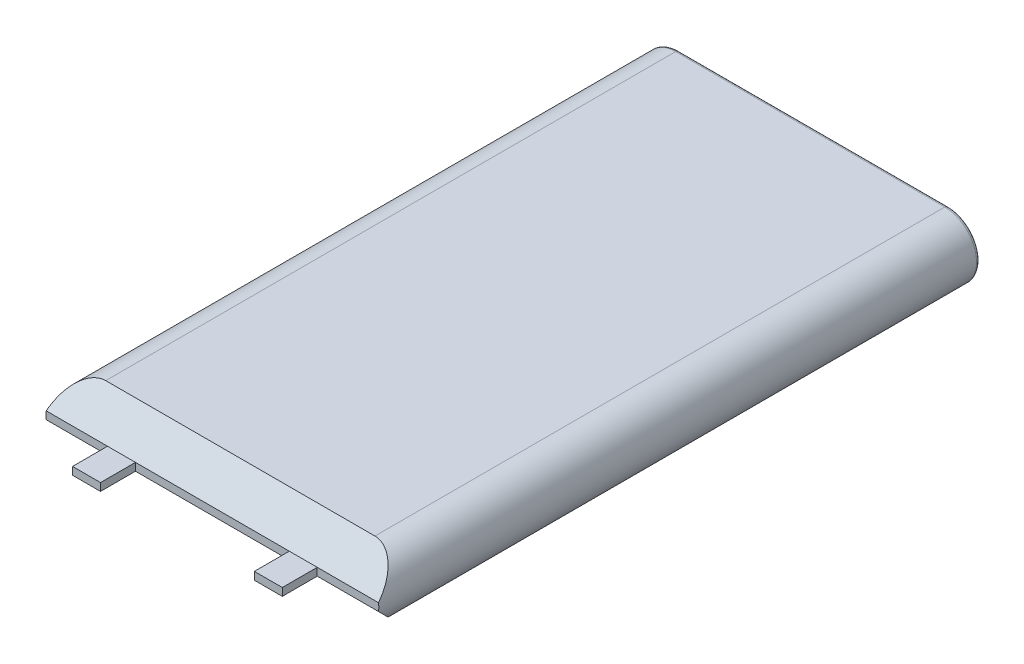
ISO-10303-21;
HEADER;
FILE_DESCRIPTION(('STEP AP214'),'2;1');
FILE_NAME('part.step','',(''),(''),'','','');
FILE_SCHEMA(('AUTOMOTIVE_DESIGN { 1 0 10303 214 1 1 1 1 }'));
ENDSEC;
DATA;
#1=APPLICATION_CONTEXT('core data for automotive mechanical design processes');
#2=APPLICATION_PROTOCOL_DEFINITION('international standard','automotive_design',2000,#1);
#3=PRODUCT_CONTEXT('',#1,'mechanical');
#4=PRODUCT('Part','Part','',(#3));
#5=PRODUCT_RELATED_PRODUCT_CATEGORY('part','',(#4));
#6=PRODUCT_DEFINITION_FORMATION('','',#4);
#7=PRODUCT_DEFINITION_CONTEXT('part definition',#1,'design');
#8=PRODUCT_DEFINITION('design','',#6,#7);
#9=PRODUCT_DEFINITION_SHAPE('','',#8);
#10=(LENGTH_UNIT() NAMED_UNIT(*) SI_UNIT(.MILLI.,.METRE.));
#11=(NAMED_UNIT(*) PLANE_ANGLE_UNIT() SI_UNIT($,.RADIAN.));
#12=(NAMED_UNIT(*) SI_UNIT($,.STERADIAN.) SOLID_ANGLE_UNIT());
#13=UNCERTAINTY_MEASURE_WITH_UNIT(LENGTH_MEASURE(1.E-05),#10,'distance_accuracy_value','');
#14=(GEOMETRIC_REPRESENTATION_CONTEXT(3) GLOBAL_UNCERTAINTY_ASSIGNED_CONTEXT((#13)) GLOBAL_UNIT_ASSIGNED_CONTEXT((#10,
#11,#12)) REPRESENTATION_CONTEXT('',''));
#15=CARTESIAN_POINT('',(0.,0.,0.));
#16=DIRECTION('',(0.,0.,1.));
#17=DIRECTION('',(1.,0.,0.));
#18=AXIS2_PLACEMENT_3D('',#15,#16,#17);
#19=CARTESIAN_POINT('',(-24.4475,0.,109.22));
#20=DIRECTION('',(0.,0.,1.));
#21=DIRECTION('',(1.,0.,0.));
#22=AXIS2_PLACEMENT_3D('',#19,#20,#21);
#23=PLANE('',#22);
#24=DIRECTION('',(-1.,0.,0.));
#25=VECTOR('',#24,1.);
#26=CARTESIAN_POINT('',(-24.4475,0.698500000000017,109.22));
#27=LINE('',#26,#25);
#28=CARTESIAN_POINT('',(30.1836276136432,0.698500000000025,109.22));
#29=VERTEX_POINT('',#28);
#30=CARTESIAN_POINT('',(19.05,0.698500000000024,109.22));
#31=VERTEX_POINT('',#30);
#32=EDGE_CURVE('E257',#29,#31,#27,.T.);
#33=ORIENTED_EDGE('',*,*,#32,.T.);
#34=DIRECTION('',(0.,1.,0.));
#35=VECTOR('',#34,1.);
#36=CARTESIAN_POINT('',(19.05,0.698500000000022,109.22));
#37=LINE('',#36,#35);
#38=CARTESIAN_POINT('',(19.05,-0.698500000000029,109.22));
#39=VERTEX_POINT('',#38);
#40=EDGE_CURVE('E51',#39,#31,#37,.T.);
#41=ORIENTED_EDGE('',*,*,#40,.F.);
#42=DIRECTION('',(1.,0.,0.));
#43=VECTOR('',#42,1.);
#44=CARTESIAN_POINT('',(24.4475,-0.698500000000027,109.22));
#45=LINE('',#44,#43);
#46=CARTESIAN_POINT('',(30.1836276136432,-0.698500000000026,109.22));
#47=VERTEX_POINT('',#46);
#48=EDGE_CURVE('E259',#39,#47,#45,.T.);
#49=ORIENTED_EDGE('',*,*,#48,.T.);
#50=CARTESIAN_POINT('',(24.4475,0.,109.22));
#51=DIRECTION('',(0.,0.,1.));
#52=DIRECTION('',(1.,0.,0.));
#53=AXIS2_PLACEMENT_3D('',#50,#51,#52);
#54=CIRCLE('',#53,5.7785);
#55=EDGE_CURVE('E214',#47,#29,#54,.T.);
#56=ORIENTED_EDGE('',*,*,#55,.T.);
#57=EDGE_LOOP('',(#33,#41,#49,#56));
#58=FACE_BOUND('',#57,.T.);
#59=ADVANCED_FACE('F35',(#58),#23,.T.);
#60=CARTESIAN_POINT('',(-13.97,-0.698500000000037,109.22));
#61=VERTEX_POINT('',#60);
#62=CARTESIAN_POINT('',(13.97,-0.69850000000003,109.22));
#63=VERTEX_POINT('',#62);
#64=EDGE_CURVE('E265',#61,#63,#45,.T.);
#65=ORIENTED_EDGE('',*,*,#64,.T.);
#66=DIRECTION('',(0.,-1.,0.));
#67=VECTOR('',#66,1.);
#68=CARTESIAN_POINT('',(13.97,0.698500000000021,109.22));
#69=LINE('',#68,#67);
#70=CARTESIAN_POINT('',(13.97,0.698500000000021,109.22));
#71=VERTEX_POINT('',#70);
#72=EDGE_CURVE('E433',#71,#63,#69,.T.);
#73=ORIENTED_EDGE('',*,*,#72,.F.);
#74=CARTESIAN_POINT('',(-13.97,0.698500000000018,109.22));
#75=VERTEX_POINT('',#74);
#76=EDGE_CURVE('E260',#71,#75,#27,.T.);
#77=ORIENTED_EDGE('',*,*,#76,.T.);
#78=DIRECTION('',(0.,1.,0.));
#79=VECTOR('',#78,1.);
#80=CARTESIAN_POINT('',(-13.97,0.698500000000018,109.22));
#81=LINE('',#80,#79);
#82=EDGE_CURVE('E194',#61,#75,#81,.T.);
#83=ORIENTED_EDGE('',*,*,#82,.F.);
#84=EDGE_LOOP('',(#65,#73,#77,#83));
#85=FACE_BOUND('',#84,.T.);
#86=ADVANCED_FACE('F314',(#85),#23,.T.);
#87=DIRECTION('',(0.,-1.,0.));
#88=VECTOR('',#87,1.);
#89=CARTESIAN_POINT('',(-19.05,0.698500000000018,109.22));
#90=LINE('',#89,#88);
#91=CARTESIAN_POINT('',(-19.05,0.698500000000018,109.22));
#92=VERTEX_POINT('',#91);
#93=CARTESIAN_POINT('',(-19.05,-0.698500000000039,109.22));
#94=VERTEX_POINT('',#93);
#95=EDGE_CURVE('E172',#92,#94,#90,.T.);
#96=ORIENTED_EDGE('',*,*,#95,.F.);
#97=CARTESIAN_POINT('',(-30.1836276136432,0.698500000000016,109.22));
#98=VERTEX_POINT('',#97);
#99=EDGE_CURVE('E247',#92,#98,#27,.T.);
#100=ORIENTED_EDGE('',*,*,#99,.T.);
#101=CARTESIAN_POINT('',(-24.4475,0.,109.22));
#102=DIRECTION('',(0.,0.,1.));
#103=DIRECTION('',(1.,0.,0.));
#104=AXIS2_PLACEMENT_3D('',#101,#102,#103);
#105=CIRCLE('',#104,5.7785);
#106=CARTESIAN_POINT('',(-30.1836276136432,-0.698500000000042,109.22));
#107=VERTEX_POINT('',#106);
#108=EDGE_CURVE('E211',#98,#107,#105,.T.);
#109=ORIENTED_EDGE('',*,*,#108,.T.);
#110=EDGE_CURVE('E261',#107,#94,#45,.T.);
#111=ORIENTED_EDGE('',*,*,#110,.T.);
#112=EDGE_LOOP('',(#96,#100,#109,#111));
#113=FACE_BOUND('',#112,.T.);
#114=ADVANCED_FACE('F280',(#113),#23,.T.);
#115=CARTESIAN_POINT('',(-24.4475,0.,109.22));
#116=DIRECTION('',(0.,0.,-1.));
#117=DIRECTION('',(-1.,0.,0.));
#118=AXIS2_PLACEMENT_3D('',#115,#116,#117);
#119=CYLINDRICAL_SURFACE('',#118,5.7785);
#120=DIRECTION('',(0.,0.,-1.));
#121=VECTOR('',#120,1.);
#122=CARTESIAN_POINT('',(-24.4475,-5.77850000000001,109.22));
#123=LINE('',#122,#121);
#124=CARTESIAN_POINT('',(-24.4475,-5.77850000000001,104.14));
#125=VERTEX_POINT('',#124);
#126=CARTESIAN_POINT('',(-24.4475,-5.77850000000001,0.634999999999997));
#127=VERTEX_POINT('',#126);
#128=EDGE_CURVE('E224',#125,#127,#123,.T.);
#129=ORIENTED_EDGE('',*,*,#128,.F.);
#130=CARTESIAN_POINT('',(-24.4475,0.,109.9185));
#131=DIRECTION('',(0.,-0.70710678118655,0.707106781186546));
#132=DIRECTION('',(0.,-0.707106781186546,-0.70710678118655));
#133=AXIS2_PLACEMENT_3D('',#130,#131,#132);
#134=ELLIPSE('',#133,8.17203307017295,5.7785);
#135=EDGE_CURVE('E44',#125,#107,#134,.F.);
#136=ORIENTED_EDGE('',*,*,#135,.T.);
#137=ORIENTED_EDGE('',*,*,#108,.F.);
#138=CARTESIAN_POINT('',(-24.4475,0.,109.9185));
#139=DIRECTION('',(0.,0.707106781186549,0.707106781186546));
#140=DIRECTION('',(0.,0.707106781186546,-0.707106781186549));
#141=AXIS2_PLACEMENT_3D('',#138,#139,#140);
#142=ELLIPSE('',#141,8.17203307017295,5.7785);
#143=CARTESIAN_POINT('',(-24.4475,5.77849999999999,104.14));
#144=VERTEX_POINT('',#143);
#145=EDGE_CURVE('E271',#98,#144,#142,.F.);
#146=ORIENTED_EDGE('',*,*,#145,.T.);
#147=DIRECTION('',(0.,0.,-1.));
#148=VECTOR('',#147,1.);
#149=CARTESIAN_POINT('',(-24.4475,5.77849999999999,109.22));
#150=LINE('',#149,#148);
#151=CARTESIAN_POINT('',(-24.4475,5.77849999999999,0.634999999999997));
#152=VERTEX_POINT('',#151);
#153=EDGE_CURVE('E218',#144,#152,#150,.T.);
#154=ORIENTED_EDGE('',*,*,#153,.T.);
#155=CARTESIAN_POINT('',(-24.4475,0.,0.634999999999997));
#156=DIRECTION('',(0.,0.,1.));
#157=DIRECTION('',(1.,0.,0.));
#158=AXIS2_PLACEMENT_3D('',#155,#156,#157);
#159=CIRCLE('',#158,5.7785);
#160=EDGE_CURVE('E244',#152,#127,#159,.T.);
#161=ORIENTED_EDGE('',*,*,#160,.T.);
#162=EDGE_LOOP('',(#129,#136,#137,#146,#154,#161));
#163=FACE_BOUND('',#162,.T.);
#164=ADVANCED_FACE('F276',(#163),#119,.T.);
#165=CARTESIAN_POINT('',(24.4475,-5.7785,109.22));
#166=DIRECTION('',(0.,1.,0.));
#167=DIRECTION('',(-1.,0.,0.));
#168=AXIS2_PLACEMENT_3D('',#165,#166,#167);
#169=PLANE('',#168);
#170=DIRECTION('',(0.,0.,-1.));
#171=VECTOR('',#170,1.);
#172=CARTESIAN_POINT('',(24.4475,-5.7785,109.22));
#173=LINE('',#172,#171);
#174=CARTESIAN_POINT('',(24.4475,-5.7785,104.14));
#175=VERTEX_POINT('',#174);
#176=CARTESIAN_POINT('',(24.4475,-5.7785,0.634999999999997));
#177=VERTEX_POINT('',#176);
#178=EDGE_CURVE('E222',#175,#177,#173,.T.);
#179=ORIENTED_EDGE('',*,*,#178,.F.);
#180=DIRECTION('',(-1.,0.,0.));
#181=VECTOR('',#180,1.);
#182=CARTESIAN_POINT('',(-24.4475,-5.77850000000001,104.14));
#183=LINE('',#182,#181);
#184=EDGE_CURVE('E269',#175,#125,#183,.T.);
#185=ORIENTED_EDGE('',*,*,#184,.T.);
#186=ORIENTED_EDGE('',*,*,#128,.T.);
#187=DIRECTION('',(1.,0.,0.));
#188=VECTOR('',#187,1.);
#189=CARTESIAN_POINT('',(24.4475,-5.7785,0.634999999999997));
#190=LINE('',#189,#188);
#191=EDGE_CURVE('E226',#127,#177,#190,.T.);
#192=ORIENTED_EDGE('',*,*,#191,.T.);
#193=EDGE_LOOP('',(#179,#185,#186,#192));
#194=FACE_BOUND('',#193,.T.);
#195=ADVANCED_FACE('F326',(#194),#169,.F.);
#196=CARTESIAN_POINT('',(24.4475,0.,109.22));
#197=DIRECTION('',(0.,0.,-1.));
#198=DIRECTION('',(-1.,0.,0.));
#199=AXIS2_PLACEMENT_3D('',#196,#197,#198);
#200=CYLINDRICAL_SURFACE('',#199,5.7785);
#201=ORIENTED_EDGE('',*,*,#55,.F.);
#202=CARTESIAN_POINT('',(24.4475,0.,109.9185));
#203=DIRECTION('',(0.,-0.70710678118655,0.707106781186546));
#204=DIRECTION('',(0.,-0.707106781186546,-0.70710678118655));
#205=AXIS2_PLACEMENT_3D('',#202,#203,#204);
#206=ELLIPSE('',#205,8.17203307017295,5.7785);
#207=EDGE_CURVE('E267',#47,#175,#206,.F.);
#208=ORIENTED_EDGE('',*,*,#207,.T.);
#209=ORIENTED_EDGE('',*,*,#178,.T.);
#210=CARTESIAN_POINT('',(24.4475,0.,0.634999999999997));
#211=DIRECTION('',(0.,0.,1.));
#212=DIRECTION('',(1.,0.,0.));
#213=AXIS2_PLACEMENT_3D('',#210,#211,#212);
#214=CIRCLE('',#213,5.7785);
#215=CARTESIAN_POINT('',(24.4475,5.7785,0.634999999999997));
#216=VERTEX_POINT('',#215);
#217=EDGE_CURVE('E238',#177,#216,#214,.T.);
#218=ORIENTED_EDGE('',*,*,#217,.T.);
#219=DIRECTION('',(0.,0.,-1.));
#220=VECTOR('',#219,1.);
#221=CARTESIAN_POINT('',(24.4475,5.7785,109.22));
#222=LINE('',#221,#220);
#223=CARTESIAN_POINT('',(24.4475,5.7785,104.14));
#224=VERTEX_POINT('',#223);
#225=EDGE_CURVE('E220',#224,#216,#222,.T.);
#226=ORIENTED_EDGE('',*,*,#225,.F.);
#227=CARTESIAN_POINT('',(24.4475,0.,109.9185));
#228=DIRECTION('',(0.,0.707106781186549,0.707106781186546));
#229=DIRECTION('',(0.,0.707106781186546,-0.707106781186549));
#230=AXIS2_PLACEMENT_3D('',#227,#228,#229);
#231=ELLIPSE('',#230,8.17203307017295,5.7785);
#232=EDGE_CURVE('E264',#224,#29,#231,.F.);
#233=ORIENTED_EDGE('',*,*,#232,.T.);
#234=EDGE_LOOP('',(#201,#208,#209,#218,#226,#233));
#235=FACE_BOUND('',#234,.T.);
#236=ADVANCED_FACE('F331',(#235),#200,.T.);
#237=CARTESIAN_POINT('',(24.4475,5.7785,109.22));
#238=DIRECTION('',(0.,-1.,0.));
#239=DIRECTION('',(1.,0.,0.));
#240=AXIS2_PLACEMENT_3D('',#237,#238,#239);
#241=PLANE('',#240);
#242=ORIENTED_EDGE('',*,*,#153,.F.);
#243=DIRECTION('',(1.,0.,0.));
#244=VECTOR('',#243,1.);
#245=CARTESIAN_POINT('',(24.4475,5.7785,104.14));
#246=LINE('',#245,#244);
#247=EDGE_CURVE('E11',#144,#224,#246,.T.);
#248=ORIENTED_EDGE('',*,*,#247,.T.);
#249=ORIENTED_EDGE('',*,*,#225,.T.);
#250=DIRECTION('',(-1.,0.,0.));
#251=VECTOR('',#250,1.);
#252=CARTESIAN_POINT('',(24.4475,5.7785,0.634999999999997));
#253=LINE('',#252,#251);
#254=EDGE_CURVE('E241',#216,#152,#253,.T.);
#255=ORIENTED_EDGE('',*,*,#254,.T.);
#256=EDGE_LOOP('',(#242,#248,#249,#255));
#257=FACE_BOUND('',#256,.T.);
#258=ADVANCED_FACE('F452',(#257),#241,.F.);
#259=CARTESIAN_POINT('',(-24.4475,0.,0.));
#260=DIRECTION('',(0.,0.,1.));
#261=DIRECTION('',(1.,0.,0.));
#262=AXIS2_PLACEMENT_3D('',#259,#260,#261);
#263=PLANE('',#262);
#264=CARTESIAN_POINT('',(24.4475,0.,0.));
#265=DIRECTION('',(0.,0.,1.));
#266=DIRECTION('',(1.,0.,0.));
#267=AXIS2_PLACEMENT_3D('',#264,#265,#266);
#268=CIRCLE('',#267,5.1435);
#269=CARTESIAN_POINT('',(24.4475,5.1435,0.));
#270=VERTEX_POINT('',#269);
#271=CARTESIAN_POINT('',(24.4475,-5.1435,0.));
#272=VERTEX_POINT('',#271);
#273=EDGE_CURVE('E233',#270,#272,#268,.F.);
#274=ORIENTED_EDGE('',*,*,#273,.T.);
#275=DIRECTION('',(1.,0.,0.));
#276=VECTOR('',#275,1.);
#277=CARTESIAN_POINT('',(-24.4475,-5.14350000000001,0.));
#278=LINE('',#277,#276);
#279=CARTESIAN_POINT('',(-24.4475,-5.14350000000001,0.));
#280=VERTEX_POINT('',#279);
#281=EDGE_CURVE('E235',#272,#280,#278,.F.);
#282=ORIENTED_EDGE('',*,*,#281,.T.);
#283=CARTESIAN_POINT('',(-24.4475,0.,0.));
#284=DIRECTION('',(0.,0.,1.));
#285=DIRECTION('',(1.,0.,0.));
#286=AXIS2_PLACEMENT_3D('',#283,#284,#285);
#287=CIRCLE('',#286,5.1435);
#288=CARTESIAN_POINT('',(-24.4475,5.14349999999999,0.));
#289=VERTEX_POINT('',#288);
#290=EDGE_CURVE('E229',#280,#289,#287,.F.);
#291=ORIENTED_EDGE('',*,*,#290,.T.);
#292=DIRECTION('',(-1.,0.,0.));
#293=VECTOR('',#292,1.);
#294=CARTESIAN_POINT('',(-24.4475,5.14349999999999,0.));
#295=LINE('',#294,#293);
#296=EDGE_CURVE('E231',#289,#270,#295,.F.);
#297=ORIENTED_EDGE('',*,*,#296,.T.);
#298=EDGE_LOOP('',(#274,#282,#291,#297));
#299=FACE_BOUND('',#298,.T.);
#300=ADVANCED_FACE('F350',(#299),#263,.F.);
#301=CARTESIAN_POINT('',(24.4475,5.1435,0.634999999999997));
#302=DIRECTION('',(-1.,0.,0.));
#303=DIRECTION('',(0.,-1.,0.));
#304=AXIS2_PLACEMENT_3D('',#301,#302,#303);
#305=CYLINDRICAL_SURFACE('',#304,0.635);
#306=CARTESIAN_POINT('',(24.4475,5.1435,0.635));
#307=DIRECTION('',(1.,0.,0.));
#308=DIRECTION('',(0.,0.,-1.));
#309=AXIS2_PLACEMENT_3D('',#306,#307,#308);
#310=CIRCLE('',#309,0.635);
#311=EDGE_CURVE('E252',#270,#216,#310,.T.);
#312=ORIENTED_EDGE('',*,*,#311,.F.);
#313=ORIENTED_EDGE('',*,*,#296,.F.);
#314=CARTESIAN_POINT('',(-24.4475,5.14349999999999,0.634999999999997));
#315=DIRECTION('',(-1.,0.,0.));
#316=DIRECTION('',(0.,0.,1.));
#317=AXIS2_PLACEMENT_3D('',#314,#315,#316);
#318=CIRCLE('',#317,0.635);
#319=EDGE_CURVE('E215',#152,#289,#318,.T.);
#320=ORIENTED_EDGE('',*,*,#319,.F.);
#321=ORIENTED_EDGE('',*,*,#254,.F.);
#322=EDGE_LOOP('',(#312,#313,#320,#321));
#323=FACE_BOUND('',#322,.T.);
#324=ADVANCED_FACE('F347',(#323),#305,.T.);
#325=CARTESIAN_POINT('',(-24.4475,0.,0.634999999999997));
#326=DIRECTION('',(0.,0.,1.));
#327=DIRECTION('',(1.,0.,0.));
#328=AXIS2_PLACEMENT_3D('',#325,#326,#327);
#329=TOROIDAL_SURFACE('',#328,5.1435,0.635);
#330=ORIENTED_EDGE('',*,*,#319,.T.);
#331=ORIENTED_EDGE('',*,*,#290,.F.);
#332=CARTESIAN_POINT('',(-24.4475,-5.14350000000001,0.634999999999997));
#333=DIRECTION('',(1.,0.,0.));
#334=DIRECTION('',(0.,0.,-1.));
#335=AXIS2_PLACEMENT_3D('',#332,#333,#334);
#336=CIRCLE('',#335,0.635);
#337=EDGE_CURVE('E250',#127,#280,#336,.T.);
#338=ORIENTED_EDGE('',*,*,#337,.F.);
#339=ORIENTED_EDGE('',*,*,#160,.F.);
#340=EDGE_LOOP('',(#330,#331,#338,#339));
#341=FACE_BOUND('',#340,.T.);
#342=ADVANCED_FACE('F343',(#341),#329,.T.);
#343=CARTESIAN_POINT('',(24.4475,0.,0.634999999999997));
#344=DIRECTION('',(0.,0.,1.));
#345=DIRECTION('',(1.,0.,0.));
#346=AXIS2_PLACEMENT_3D('',#343,#344,#345);
#347=TOROIDAL_SURFACE('',#346,5.1435,0.635);
#348=ORIENTED_EDGE('',*,*,#311,.T.);
#349=ORIENTED_EDGE('',*,*,#217,.F.);
#350=CARTESIAN_POINT('',(24.4475,-5.1435,0.635));
#351=DIRECTION('',(-1.,0.,0.));
#352=DIRECTION('',(0.,0.,1.));
#353=AXIS2_PLACEMENT_3D('',#350,#351,#352);
#354=CIRCLE('',#353,0.635);
#355=EDGE_CURVE('E210',#272,#177,#354,.T.);
#356=ORIENTED_EDGE('',*,*,#355,.F.);
#357=ORIENTED_EDGE('',*,*,#273,.F.);
#358=EDGE_LOOP('',(#348,#349,#356,#357));
#359=FACE_BOUND('',#358,.T.);
#360=ADVANCED_FACE('F339',(#359),#347,.T.);
#361=CARTESIAN_POINT('',(24.4475,-5.1435,0.634999999999997));
#362=DIRECTION('',(1.,0.,0.));
#363=DIRECTION('',(0.,1.,0.));
#364=AXIS2_PLACEMENT_3D('',#361,#362,#363);
#365=CYLINDRICAL_SURFACE('',#364,0.635);
#366=ORIENTED_EDGE('',*,*,#337,.T.);
#367=ORIENTED_EDGE('',*,*,#281,.F.);
#368=ORIENTED_EDGE('',*,*,#355,.T.);
#369=ORIENTED_EDGE('',*,*,#191,.F.);
#370=EDGE_LOOP('',(#366,#367,#368,#369));
#371=FACE_BOUND('',#370,.T.);
#372=ADVANCED_FACE('F336',(#371),#365,.T.);
#373=CARTESIAN_POINT('',(-24.4475,-0.69850000000004,109.22));
#374=DIRECTION('',(0.,-0.70710678118655,0.707106781186546));
#375=DIRECTION('',(-1.,0.,0.));
#376=AXIS2_PLACEMENT_3D('',#373,#374,#375);
#377=PLANE('',#376);
#378=ORIENTED_EDGE('',*,*,#135,.F.);
#379=ORIENTED_EDGE('',*,*,#184,.F.);
#380=ORIENTED_EDGE('',*,*,#207,.F.);
#381=ORIENTED_EDGE('',*,*,#48,.F.);
#382=DIRECTION('',(1.,0.,0.));
#383=VECTOR('',#382,1.);
#384=CARTESIAN_POINT('',(19.05,-0.698500000000036,109.22));
#385=LINE('',#384,#383);
#386=EDGE_CURVE('E58',#63,#39,#385,.T.);
#387=ORIENTED_EDGE('',*,*,#386,.F.);
#388=ORIENTED_EDGE('',*,*,#64,.F.);
#389=DIRECTION('',(1.,0.,0.));
#390=VECTOR('',#389,1.);
#391=CARTESIAN_POINT('',(-19.05,-0.698500000000041,109.22));
#392=LINE('',#391,#390);
#393=EDGE_CURVE('E175',#94,#61,#392,.T.);
#394=ORIENTED_EDGE('',*,*,#393,.F.);
#395=ORIENTED_EDGE('',*,*,#110,.F.);
#396=EDGE_LOOP('',(#378,#379,#380,#381,#387,#388,#394,#395));
#397=FACE_BOUND('',#396,.T.);
#398=ADVANCED_FACE('F283',(#397),#377,.T.);
#399=CARTESIAN_POINT('',(-24.4475,0.698500000000017,109.22));
#400=DIRECTION('',(0.,0.707106781186549,0.707106781186546));
#401=DIRECTION('',(1.,0.,0.));
#402=AXIS2_PLACEMENT_3D('',#399,#400,#401);
#403=PLANE('',#402);
#404=ORIENTED_EDGE('',*,*,#232,.F.);
#405=ORIENTED_EDGE('',*,*,#247,.F.);
#406=ORIENTED_EDGE('',*,*,#145,.F.);
#407=ORIENTED_EDGE('',*,*,#99,.F.);
#408=DIRECTION('',(-1.,0.,0.));
#409=VECTOR('',#408,1.);
#410=CARTESIAN_POINT('',(-19.05,0.698500000000018,109.22));
#411=LINE('',#410,#409);
#412=EDGE_CURVE('E185',#75,#92,#411,.T.);
#413=ORIENTED_EDGE('',*,*,#412,.F.);
#414=ORIENTED_EDGE('',*,*,#76,.F.);
#415=DIRECTION('',(-1.,0.,0.));
#416=VECTOR('',#415,1.);
#417=CARTESIAN_POINT('',(19.05,0.698500000000022,109.22));
#418=LINE('',#417,#416);
#419=EDGE_CURVE('E440',#31,#71,#418,.T.);
#420=ORIENTED_EDGE('',*,*,#419,.F.);
#421=ORIENTED_EDGE('',*,*,#32,.F.);
#422=EDGE_LOOP('',(#404,#405,#406,#407,#413,#414,#420,#421));
#423=FACE_BOUND('',#422,.T.);
#424=ADVANCED_FACE('F38',(#423),#403,.T.);
#425=CARTESIAN_POINT('',(-19.05,0.698500000000018,115.57));
#426=DIRECTION('',(1.,0.,0.));
#427=DIRECTION('',(0.,0.,-1.));
#428=AXIS2_PLACEMENT_3D('',#425,#426,#427);
#429=PLANE('',#428);
#430=ORIENTED_EDGE('',*,*,#95,.T.);
#431=DIRECTION('',(0.,0.,-1.));
#432=VECTOR('',#431,1.);
#433=CARTESIAN_POINT('',(-19.05,-0.698500000000041,115.57));
#434=LINE('',#433,#432);
#435=CARTESIAN_POINT('',(-19.05,-0.698500000000041,115.57));
#436=VERTEX_POINT('',#435);
#437=EDGE_CURVE('E207',#436,#94,#434,.T.);
#438=ORIENTED_EDGE('',*,*,#437,.F.);
#439=DIRECTION('',(0.,-1.,0.));
#440=VECTOR('',#439,1.);
#441=CARTESIAN_POINT('',(-19.05,0.698500000000018,115.57));
#442=LINE('',#441,#440);
#443=CARTESIAN_POINT('',(-19.05,0.698500000000018,115.57));
#444=VERTEX_POINT('',#443);
#445=EDGE_CURVE('E181',#444,#436,#442,.T.);
#446=ORIENTED_EDGE('',*,*,#445,.F.);
#447=DIRECTION('',(0.,0.,-1.));
#448=VECTOR('',#447,1.);
#449=CARTESIAN_POINT('',(-19.05,0.698500000000018,115.57));
#450=LINE('',#449,#448);
#451=EDGE_CURVE('E190',#444,#92,#450,.T.);
#452=ORIENTED_EDGE('',*,*,#451,.T.);
#453=EDGE_LOOP('',(#430,#438,#446,#452));
#454=FACE_BOUND('',#453,.T.);
#455=ADVANCED_FACE('F298',(#454),#429,.F.);
#456=CARTESIAN_POINT('',(-19.05,-0.698500000000041,115.57));
#457=DIRECTION('',(0.,1.,0.));
#458=DIRECTION('',(0.,0.,1.));
#459=AXIS2_PLACEMENT_3D('',#456,#457,#458);
#460=PLANE('',#459);
#461=ORIENTED_EDGE('',*,*,#393,.T.);
#462=DIRECTION('',(0.,0.,-1.));
#463=VECTOR('',#462,1.);
#464=CARTESIAN_POINT('',(-13.97,-0.698500000000041,115.57));
#465=LINE('',#464,#463);
#466=CARTESIAN_POINT('',(-13.97,-0.698500000000041,115.57));
#467=VERTEX_POINT('',#466);
#468=EDGE_CURVE('E204',#467,#61,#465,.T.);
#469=ORIENTED_EDGE('',*,*,#468,.F.);
#470=DIRECTION('',(1.,0.,0.));
#471=VECTOR('',#470,1.);
#472=CARTESIAN_POINT('',(-19.05,-0.698500000000041,115.57));
#473=LINE('',#472,#471);
#474=EDGE_CURVE('E184',#436,#467,#473,.T.);
#475=ORIENTED_EDGE('',*,*,#474,.F.);
#476=ORIENTED_EDGE('',*,*,#437,.T.);
#477=EDGE_LOOP('',(#461,#469,#475,#476));
#478=FACE_BOUND('',#477,.T.);
#479=ADVANCED_FACE('F286',(#478),#460,.F.);
#480=CARTESIAN_POINT('',(-13.97,0.698500000000018,115.57));
#481=DIRECTION('',(-1.,0.,0.));
#482=DIRECTION('',(0.,0.,1.));
#483=AXIS2_PLACEMENT_3D('',#480,#481,#482);
#484=PLANE('',#483);
#485=ORIENTED_EDGE('',*,*,#82,.T.);
#486=DIRECTION('',(0.,0.,-1.));
#487=VECTOR('',#486,1.);
#488=CARTESIAN_POINT('',(-13.97,0.698500000000018,115.57));
#489=LINE('',#488,#487);
#490=CARTESIAN_POINT('',(-13.97,0.698500000000018,115.57));
#491=VERTEX_POINT('',#490);
#492=EDGE_CURVE('E201',#491,#75,#489,.T.);
#493=ORIENTED_EDGE('',*,*,#492,.F.);
#494=DIRECTION('',(0.,1.,0.));
#495=VECTOR('',#494,1.);
#496=CARTESIAN_POINT('',(-13.97,0.698500000000018,115.57));
#497=LINE('',#496,#495);
#498=EDGE_CURVE('E187',#467,#491,#497,.T.);
#499=ORIENTED_EDGE('',*,*,#498,.F.);
#500=ORIENTED_EDGE('',*,*,#468,.T.);
#501=EDGE_LOOP('',(#485,#493,#499,#500));
#502=FACE_BOUND('',#501,.T.);
#503=ADVANCED_FACE('F290',(#502),#484,.F.);
#504=CARTESIAN_POINT('',(-19.05,0.698500000000018,115.57));
#505=DIRECTION('',(0.,-1.,0.));
#506=DIRECTION('',(0.,0.,-1.));
#507=AXIS2_PLACEMENT_3D('',#504,#505,#506);
#508=PLANE('',#507);
#509=ORIENTED_EDGE('',*,*,#412,.T.);
#510=ORIENTED_EDGE('',*,*,#451,.F.);
#511=DIRECTION('',(-1.,0.,0.));
#512=VECTOR('',#511,1.);
#513=CARTESIAN_POINT('',(-19.05,0.698500000000018,115.57));
#514=LINE('',#513,#512);
#515=EDGE_CURVE('E189',#491,#444,#514,.T.);
#516=ORIENTED_EDGE('',*,*,#515,.F.);
#517=ORIENTED_EDGE('',*,*,#492,.T.);
#518=EDGE_LOOP('',(#509,#510,#516,#517));
#519=FACE_BOUND('',#518,.T.);
#520=ADVANCED_FACE('F304',(#519),#508,.F.);
#521=CARTESIAN_POINT('',(0.,0.,115.57));
#522=DIRECTION('',(0.,0.,1.));
#523=DIRECTION('',(1.,0.,0.));
#524=AXIS2_PLACEMENT_3D('',#521,#522,#523);
#525=PLANE('',#524);
#526=ORIENTED_EDGE('',*,*,#445,.T.);
#527=ORIENTED_EDGE('',*,*,#474,.T.);
#528=ORIENTED_EDGE('',*,*,#498,.T.);
#529=ORIENTED_EDGE('',*,*,#515,.T.);
#530=EDGE_LOOP('',(#526,#527,#528,#529));
#531=FACE_BOUND('',#530,.T.);
#532=ADVANCED_FACE('F294',(#531),#525,.T.);
#533=CARTESIAN_POINT('',(19.05,0.698500000000022,115.57));
#534=DIRECTION('',(-1.,0.,0.));
#535=DIRECTION('',(0.,0.,1.));
#536=AXIS2_PLACEMENT_3D('',#533,#534,#535);
#537=PLANE('',#536);
#538=ORIENTED_EDGE('',*,*,#40,.T.);
#539=DIRECTION('',(0.,0.,-1.));
#540=VECTOR('',#539,1.);
#541=CARTESIAN_POINT('',(19.05,0.698500000000022,115.57));
#542=LINE('',#541,#540);
#543=CARTESIAN_POINT('',(19.05,0.698500000000022,115.57));
#544=VERTEX_POINT('',#543);
#545=EDGE_CURVE('E155',#544,#31,#542,.T.);
#546=ORIENTED_EDGE('',*,*,#545,.F.);
#547=DIRECTION('',(0.,1.,0.));
#548=VECTOR('',#547,1.);
#549=CARTESIAN_POINT('',(19.05,0.698500000000022,115.57));
#550=LINE('',#549,#548);
#551=CARTESIAN_POINT('',(19.05,-0.698500000000036,115.57));
#552=VERTEX_POINT('',#551);
#553=EDGE_CURVE('E161',#552,#544,#550,.T.);
#554=ORIENTED_EDGE('',*,*,#553,.F.);
#555=DIRECTION('',(0.,0.,-1.));
#556=VECTOR('',#555,1.);
#557=CARTESIAN_POINT('',(19.05,-0.698500000000036,115.57));
#558=LINE('',#557,#556);
#559=EDGE_CURVE('E431',#552,#39,#558,.T.);
#560=ORIENTED_EDGE('',*,*,#559,.T.);
#561=EDGE_LOOP('',(#538,#546,#554,#560));
#562=FACE_BOUND('',#561,.T.);
#563=ADVANCED_FACE('F171',(#562),#537,.F.);
#564=CARTESIAN_POINT('',(19.05,0.698500000000022,115.57));
#565=DIRECTION('',(0.,-1.,0.));
#566=DIRECTION('',(1.,0.,0.));
#567=AXIS2_PLACEMENT_3D('',#564,#565,#566);
#568=PLANE('',#567);
#569=ORIENTED_EDGE('',*,*,#419,.T.);
#570=DIRECTION('',(0.,0.,-1.));
#571=VECTOR('',#570,1.);
#572=CARTESIAN_POINT('',(13.97,0.698500000000021,115.57));
#573=LINE('',#572,#571);
#574=CARTESIAN_POINT('',(13.97,0.698500000000021,115.57));
#575=VERTEX_POINT('',#574);
#576=EDGE_CURVE('E157',#575,#71,#573,.T.);
#577=ORIENTED_EDGE('',*,*,#576,.F.);
#578=DIRECTION('',(-1.,0.,0.));
#579=VECTOR('',#578,1.);
#580=CARTESIAN_POINT('',(19.05,0.698500000000022,115.57));
#581=LINE('',#580,#579);
#582=EDGE_CURVE('E150',#544,#575,#581,.T.);
#583=ORIENTED_EDGE('',*,*,#582,.F.);
#584=ORIENTED_EDGE('',*,*,#545,.T.);
#585=EDGE_LOOP('',(#569,#577,#583,#584));
#586=FACE_BOUND('',#585,.T.);
#587=ADVANCED_FACE('F153',(#586),#568,.F.);
#588=CARTESIAN_POINT('',(13.97,0.698500000000021,115.57));
#589=DIRECTION('',(1.,0.,0.));
#590=DIRECTION('',(0.,0.,-1.));
#591=AXIS2_PLACEMENT_3D('',#588,#589,#590);
#592=PLANE('',#591);
#593=ORIENTED_EDGE('',*,*,#72,.T.);
#594=DIRECTION('',(0.,0.,-1.));
#595=VECTOR('',#594,1.);
#596=CARTESIAN_POINT('',(13.97,-0.698500000000038,115.57));
#597=LINE('',#596,#595);
#598=CARTESIAN_POINT('',(13.97,-0.698500000000038,115.57));
#599=VERTEX_POINT('',#598);
#600=EDGE_CURVE('E177',#599,#63,#597,.T.);
#601=ORIENTED_EDGE('',*,*,#600,.F.);
#602=DIRECTION('',(0.,-1.,0.));
#603=VECTOR('',#602,1.);
#604=CARTESIAN_POINT('',(13.97,0.698500000000021,115.57));
#605=LINE('',#604,#603);
#606=EDGE_CURVE('E160',#575,#599,#605,.T.);
#607=ORIENTED_EDGE('',*,*,#606,.F.);
#608=ORIENTED_EDGE('',*,*,#576,.T.);
#609=EDGE_LOOP('',(#593,#601,#607,#608));
#610=FACE_BOUND('',#609,.T.);
#611=ADVANCED_FACE('F399',(#610),#592,.F.);
#612=CARTESIAN_POINT('',(19.05,-0.698500000000036,115.57));
#613=DIRECTION('',(0.,1.,0.));
#614=DIRECTION('',(-1.,0.,0.));
#615=AXIS2_PLACEMENT_3D('',#612,#613,#614);
#616=PLANE('',#615);
#617=ORIENTED_EDGE('',*,*,#386,.T.);
#618=ORIENTED_EDGE('',*,*,#559,.F.);
#619=DIRECTION('',(1.,0.,0.));
#620=VECTOR('',#619,1.);
#621=CARTESIAN_POINT('',(19.05,-0.698500000000036,115.57));
#622=LINE('',#621,#620);
#623=EDGE_CURVE('E166',#599,#552,#622,.T.);
#624=ORIENTED_EDGE('',*,*,#623,.F.);
#625=ORIENTED_EDGE('',*,*,#600,.T.);
#626=EDGE_LOOP('',(#617,#618,#624,#625));
#627=FACE_BOUND('',#626,.T.);
#628=ADVANCED_FACE('F408',(#627),#616,.F.);
#629=CARTESIAN_POINT('',(0.,0.,115.57));
#630=DIRECTION('',(0.,0.,-1.));
#631=DIRECTION('',(-1.,0.,0.));
#632=AXIS2_PLACEMENT_3D('',#629,#630,#631);
#633=PLANE('',#632);
#634=ORIENTED_EDGE('',*,*,#553,.T.);
#635=ORIENTED_EDGE('',*,*,#582,.T.);
#636=ORIENTED_EDGE('',*,*,#606,.T.);
#637=ORIENTED_EDGE('',*,*,#623,.T.);
#638=EDGE_LOOP('',(#634,#635,#636,#637));
#639=FACE_BOUND('',#638,.T.);
#640=ADVANCED_FACE('F164',(#639),#633,.F.);
#641=CLOSED_SHELL('',(#59,#86,#114,#164,#195,#236,#258,#300,#324,#342,#360,#372,#398,#424,#455,
#479,#503,#520,#532,#563,#587,#611,#628,#640));
#642=MANIFOLD_SOLID_BREP('B2',#641);
#643=ADVANCED_BREP_SHAPE_REPRESENTATION('',(#18,#642),#14);
#644=SHAPE_DEFINITION_REPRESENTATION(#9,#643);
ENDSEC;
END-ISO-10303-21;
